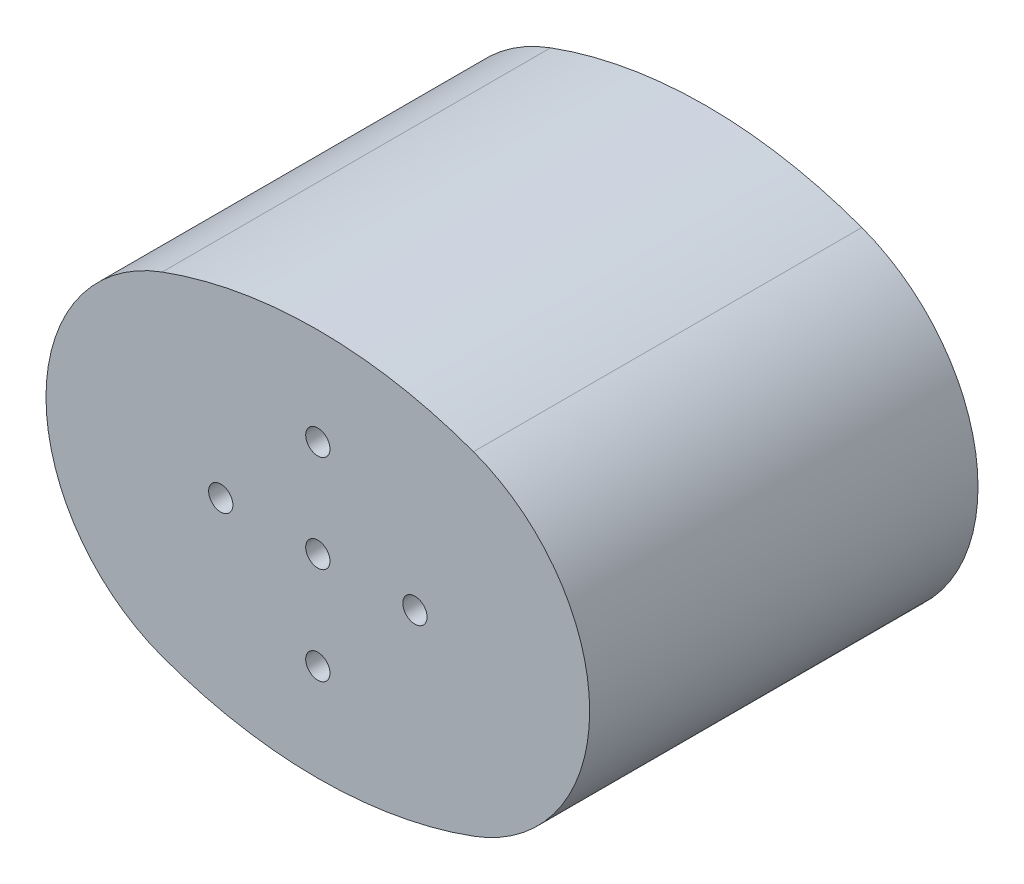
ISO-10303-21;
HEADER;
FILE_DESCRIPTION(('STEP AP214'),'2;1');
FILE_NAME('part.step','',(''),(''),'','','');
FILE_SCHEMA(('AUTOMOTIVE_DESIGN { 1 0 10303 214 1 1 1 1 }'));
ENDSEC;
DATA;
#1=APPLICATION_CONTEXT('core data for automotive mechanical design processes');
#2=APPLICATION_PROTOCOL_DEFINITION('international standard','automotive_design',2000,#1);
#3=PRODUCT_CONTEXT('',#1,'mechanical');
#4=PRODUCT('Part','Part','',(#3));
#5=PRODUCT_RELATED_PRODUCT_CATEGORY('part','',(#4));
#6=PRODUCT_DEFINITION_FORMATION('','',#4);
#7=PRODUCT_DEFINITION_CONTEXT('part definition',#1,'design');
#8=PRODUCT_DEFINITION('design','',#6,#7);
#9=PRODUCT_DEFINITION_SHAPE('','',#8);
#10=(LENGTH_UNIT() NAMED_UNIT(*) SI_UNIT(.MILLI.,.METRE.));
#11=(NAMED_UNIT(*) PLANE_ANGLE_UNIT() SI_UNIT($,.RADIAN.));
#12=(NAMED_UNIT(*) SI_UNIT($,.STERADIAN.) SOLID_ANGLE_UNIT());
#13=UNCERTAINTY_MEASURE_WITH_UNIT(LENGTH_MEASURE(1.E-05),#10,'distance_accuracy_value','');
#14=(GEOMETRIC_REPRESENTATION_CONTEXT(3) GLOBAL_UNCERTAINTY_ASSIGNED_CONTEXT((#13)) GLOBAL_UNIT_ASSIGNED_CONTEXT((#10,
#11,#12)) REPRESENTATION_CONTEXT('',''));
#15=CARTESIAN_POINT('',(0.,0.,0.));
#16=DIRECTION('',(0.,0.,1.));
#17=DIRECTION('',(1.,0.,0.));
#18=AXIS2_PLACEMENT_3D('',#15,#16,#17);
#19=CARTESIAN_POINT('',(0.,26.4889586669029,40.));
#20=DIRECTION('',(0.,0.,-1.));
#21=DIRECTION('',(-1.,0.,0.));
#22=AXIS2_PLACEMENT_3D('',#19,#20,#21);
#23=CYLINDRICAL_SURFACE('',#22,46.4889586669031);
#24=CARTESIAN_POINT('',(0.,26.4889586669029,0.));
#25=DIRECTION('',(0.,0.,1.));
#26=DIRECTION('',(1.,0.,0.));
#27=AXIS2_PLACEMENT_3D('',#24,#25,#26);
#28=CIRCLE('',#27,46.4889586669031);
#29=CARTESIAN_POINT('',(-16.0303859502735,-17.1487544287475,0.));
#30=VERTEX_POINT('',#29);
#31=CARTESIAN_POINT('',(16.0303859502735,-17.1487544287475,0.));
#32=VERTEX_POINT('',#31);
#33=EDGE_CURVE('E98',#30,#32,#28,.T.);
#34=ORIENTED_EDGE('',*,*,#33,.T.);
#35=DIRECTION('',(0.,0.,-1.));
#36=VECTOR('',#35,1.);
#37=CARTESIAN_POINT('',(16.0303859502735,-17.1487544287475,40.));
#38=LINE('',#37,#36);
#39=CARTESIAN_POINT('',(16.0303859502735,-17.1487544287475,40.));
#40=VERTEX_POINT('',#39);
#41=EDGE_CURVE('E11',#40,#32,#38,.T.);
#42=ORIENTED_EDGE('',*,*,#41,.F.);
#43=CARTESIAN_POINT('',(0.,26.4889586669029,40.));
#44=DIRECTION('',(0.,0.,1.));
#45=DIRECTION('',(1.,0.,0.));
#46=AXIS2_PLACEMENT_3D('',#43,#44,#45);
#47=CIRCLE('',#46,46.4889586669031);
#48=CARTESIAN_POINT('',(-16.0303859502735,-17.1487544287475,40.));
#49=VERTEX_POINT('',#48);
#50=EDGE_CURVE('E86',#49,#40,#47,.T.);
#51=ORIENTED_EDGE('',*,*,#50,.F.);
#52=DIRECTION('',(0.,0.,-1.));
#53=VECTOR('',#52,1.);
#54=CARTESIAN_POINT('',(-16.0303859502735,-17.1487544287475,40.));
#55=LINE('',#54,#53);
#56=EDGE_CURVE('E94',#49,#30,#55,.T.);
#57=ORIENTED_EDGE('',*,*,#56,.T.);
#58=EDGE_LOOP('',(#34,#42,#51,#57));
#59=FACE_BOUND('',#58,.T.);
#60=ADVANCED_FACE('F35',(#59),#23,.T.);
#61=CARTESIAN_POINT('',(9.73076269878195,0.,40.));
#62=DIRECTION('',(0.,0.,-1.));
#63=DIRECTION('',(-1.,0.,0.));
#64=AXIS2_PLACEMENT_3D('',#61,#62,#63);
#65=CYLINDRICAL_SURFACE('',#64,18.2692373012181);
#66=CARTESIAN_POINT('',(9.73076269878195,0.,0.));
#67=DIRECTION('',(0.,0.,1.));
#68=DIRECTION('',(1.,0.,0.));
#69=AXIS2_PLACEMENT_3D('',#66,#67,#68);
#70=CIRCLE('',#69,18.2692373012181);
#71=CARTESIAN_POINT('',(16.0303859502735,17.1487544287475,0.));
#72=VERTEX_POINT('',#71);
#73=EDGE_CURVE('E90',#32,#72,#70,.T.);
#74=ORIENTED_EDGE('',*,*,#73,.T.);
#75=DIRECTION('',(0.,0.,-1.));
#76=VECTOR('',#75,1.);
#77=CARTESIAN_POINT('',(16.0303859502735,17.1487544287475,40.));
#78=LINE('',#77,#76);
#79=CARTESIAN_POINT('',(16.0303859502735,17.1487544287475,40.));
#80=VERTEX_POINT('',#79);
#81=EDGE_CURVE('E43',#80,#72,#78,.T.);
#82=ORIENTED_EDGE('',*,*,#81,.F.);
#83=CARTESIAN_POINT('',(9.73076269878195,0.,40.));
#84=DIRECTION('',(0.,0.,1.));
#85=DIRECTION('',(1.,0.,0.));
#86=AXIS2_PLACEMENT_3D('',#83,#84,#85);
#87=CIRCLE('',#86,18.2692373012181);
#88=EDGE_CURVE('E81',#40,#80,#87,.T.);
#89=ORIENTED_EDGE('',*,*,#88,.F.);
#90=ORIENTED_EDGE('',*,*,#41,.T.);
#91=EDGE_LOOP('',(#74,#82,#89,#90));
#92=FACE_BOUND('',#91,.T.);
#93=ADVANCED_FACE('F89',(#92),#65,.T.);
#94=CARTESIAN_POINT('',(0.,-26.4889586669029,40.));
#95=DIRECTION('',(0.,0.,-1.));
#96=DIRECTION('',(-1.,0.,0.));
#97=AXIS2_PLACEMENT_3D('',#94,#95,#96);
#98=CYLINDRICAL_SURFACE('',#97,46.4889586669031);
#99=CARTESIAN_POINT('',(0.,-26.4889586669029,0.));
#100=DIRECTION('',(0.,0.,1.));
#101=DIRECTION('',(1.,0.,0.));
#102=AXIS2_PLACEMENT_3D('',#99,#100,#101);
#103=CIRCLE('',#102,46.4889586669031);
#104=CARTESIAN_POINT('',(-16.0303859502735,17.1487544287475,0.));
#105=VERTEX_POINT('',#104);
#106=EDGE_CURVE('E68',#72,#105,#103,.T.);
#107=ORIENTED_EDGE('',*,*,#106,.T.);
#108=DIRECTION('',(0.,0.,-1.));
#109=VECTOR('',#108,1.);
#110=CARTESIAN_POINT('',(-16.0303859502735,17.1487544287475,40.));
#111=LINE('',#110,#109);
#112=CARTESIAN_POINT('',(-16.0303859502735,17.1487544287475,40.));
#113=VERTEX_POINT('',#112);
#114=EDGE_CURVE('E91',#113,#105,#111,.T.);
#115=ORIENTED_EDGE('',*,*,#114,.F.);
#116=CARTESIAN_POINT('',(0.,-26.4889586669029,40.));
#117=DIRECTION('',(0.,0.,1.));
#118=DIRECTION('',(1.,0.,0.));
#119=AXIS2_PLACEMENT_3D('',#116,#117,#118);
#120=CIRCLE('',#119,46.4889586669031);
#121=EDGE_CURVE('E84',#80,#113,#120,.T.);
#122=ORIENTED_EDGE('',*,*,#121,.F.);
#123=ORIENTED_EDGE('',*,*,#81,.T.);
#124=EDGE_LOOP('',(#107,#115,#122,#123));
#125=FACE_BOUND('',#124,.T.);
#126=ADVANCED_FACE('F92',(#125),#98,.T.);
#127=CARTESIAN_POINT('',(-9.73076269878195,0.,40.));
#128=DIRECTION('',(0.,0.,-1.));
#129=DIRECTION('',(-1.,0.,0.));
#130=AXIS2_PLACEMENT_3D('',#127,#128,#129);
#131=CYLINDRICAL_SURFACE('',#130,18.2692373012181);
#132=CARTESIAN_POINT('',(-9.73076269878195,0.,0.));
#133=DIRECTION('',(0.,0.,1.));
#134=DIRECTION('',(1.,0.,0.));
#135=AXIS2_PLACEMENT_3D('',#132,#133,#134);
#136=CIRCLE('',#135,18.2692373012181);
#137=EDGE_CURVE('E74',#105,#30,#136,.T.);
#138=ORIENTED_EDGE('',*,*,#137,.T.);
#139=ORIENTED_EDGE('',*,*,#56,.F.);
#140=CARTESIAN_POINT('',(-9.73076269878195,0.,40.));
#141=DIRECTION('',(0.,0.,1.));
#142=DIRECTION('',(1.,0.,0.));
#143=AXIS2_PLACEMENT_3D('',#140,#141,#142);
#144=CIRCLE('',#143,18.2692373012181);
#145=EDGE_CURVE('E51',#113,#49,#144,.T.);
#146=ORIENTED_EDGE('',*,*,#145,.F.);
#147=ORIENTED_EDGE('',*,*,#114,.T.);
#148=EDGE_LOOP('',(#138,#139,#146,#147));
#149=FACE_BOUND('',#148,.T.);
#150=ADVANCED_FACE('F106',(#149),#131,.T.);
#151=CARTESIAN_POINT('',(4.86538134939097,13.2444793334515,40.));
#152=DIRECTION('',(0.,0.,1.));
#153=DIRECTION('',(1.,0.,0.));
#154=AXIS2_PLACEMENT_3D('',#151,#152,#153);
#155=PLANE('',#154);
#156=CARTESIAN_POINT('',(0.,10.,40.));
#157=DIRECTION('',(0.,0.,1.));
#158=DIRECTION('',(1.,0.,0.));
#159=AXIS2_PLACEMENT_3D('',#156,#157,#158);
#160=CIRCLE('',#159,1.25);
#161=CARTESIAN_POINT('',(1.25,10.,40.));
#162=VERTEX_POINT('',#161);
#163=EDGE_CURVE('E125',#162,#162,#160,.T.);
#164=ORIENTED_EDGE('',*,*,#163,.F.);
#165=EDGE_LOOP('',(#164));
#166=FACE_BOUND('',#165,.T.);
#167=CARTESIAN_POINT('',(-10.,1.04744440165294E-13,40.));
#168=DIRECTION('',(0.,0.,1.));
#169=DIRECTION('',(1.,0.,0.));
#170=AXIS2_PLACEMENT_3D('',#167,#168,#169);
#171=CIRCLE('',#170,1.25);
#172=CARTESIAN_POINT('',(-8.75,1.04744440165294E-13,40.));
#173=VERTEX_POINT('',#172);
#174=EDGE_CURVE('E126',#173,#173,#171,.T.);
#175=ORIENTED_EDGE('',*,*,#174,.F.);
#176=EDGE_LOOP('',(#175));
#177=FACE_BOUND('',#176,.T.);
#178=CARTESIAN_POINT('',(0.,-10.,40.));
#179=DIRECTION('',(0.,0.,1.));
#180=DIRECTION('',(1.,0.,0.));
#181=AXIS2_PLACEMENT_3D('',#178,#179,#180);
#182=CIRCLE('',#181,1.25);
#183=CARTESIAN_POINT('',(1.24999999999993,-10.,40.));
#184=VERTEX_POINT('',#183);
#185=EDGE_CURVE('E132',#184,#184,#182,.T.);
#186=ORIENTED_EDGE('',*,*,#185,.F.);
#187=EDGE_LOOP('',(#186));
#188=FACE_BOUND('',#187,.T.);
#189=CARTESIAN_POINT('',(10.,0.,40.));
#190=DIRECTION('',(0.,0.,1.));
#191=DIRECTION('',(1.,0.,0.));
#192=AXIS2_PLACEMENT_3D('',#189,#190,#191);
#193=CIRCLE('',#192,1.25);
#194=CARTESIAN_POINT('',(11.25,0.,40.));
#195=VERTEX_POINT('',#194);
#196=EDGE_CURVE('E112',#195,#195,#193,.T.);
#197=ORIENTED_EDGE('',*,*,#196,.F.);
#198=EDGE_LOOP('',(#197));
#199=FACE_BOUND('',#198,.T.);
#200=CARTESIAN_POINT('',(0.,0.,40.));
#201=DIRECTION('',(0.,0.,1.));
#202=DIRECTION('',(1.,0.,0.));
#203=AXIS2_PLACEMENT_3D('',#200,#201,#202);
#204=CIRCLE('',#203,1.25);
#205=CARTESIAN_POINT('',(1.25,0.,40.));
#206=VERTEX_POINT('',#205);
#207=EDGE_CURVE('E119',#206,#206,#204,.T.);
#208=ORIENTED_EDGE('',*,*,#207,.F.);
#209=EDGE_LOOP('',(#208));
#210=FACE_BOUND('',#209,.T.);
#211=ORIENTED_EDGE('',*,*,#50,.T.);
#212=ORIENTED_EDGE('',*,*,#88,.T.);
#213=ORIENTED_EDGE('',*,*,#121,.T.);
#214=ORIENTED_EDGE('',*,*,#145,.T.);
#215=EDGE_LOOP('',(#211,#212,#213,#214));
#216=FACE_BOUND('',#215,.T.);
#217=ADVANCED_FACE('F82',(#166,#177,#188,#199,#210,#216),#155,.T.);
#218=CARTESIAN_POINT('',(4.86538134939097,13.2444793334515,0.));
#219=DIRECTION('',(0.,0.,1.));
#220=DIRECTION('',(1.,0.,0.));
#221=AXIS2_PLACEMENT_3D('',#218,#219,#220);
#222=PLANE('',#221);
#223=CARTESIAN_POINT('',(0.,10.,0.));
#224=DIRECTION('',(0.,0.,1.));
#225=DIRECTION('',(1.,0.,0.));
#226=AXIS2_PLACEMENT_3D('',#223,#224,#225);
#227=CIRCLE('',#226,1.25);
#228=CARTESIAN_POINT('',(1.25,10.,0.));
#229=VERTEX_POINT('',#228);
#230=EDGE_CURVE('E101',#229,#229,#227,.T.);
#231=ORIENTED_EDGE('',*,*,#230,.T.);
#232=EDGE_LOOP('',(#231));
#233=FACE_BOUND('',#232,.T.);
#234=CARTESIAN_POINT('',(-10.,1.04744440165294E-13,0.));
#235=DIRECTION('',(0.,0.,1.));
#236=DIRECTION('',(1.,0.,0.));
#237=AXIS2_PLACEMENT_3D('',#234,#235,#236);
#238=CIRCLE('',#237,1.25);
#239=CARTESIAN_POINT('',(-8.75,1.04744440165294E-13,0.));
#240=VERTEX_POINT('',#239);
#241=EDGE_CURVE('E129',#240,#240,#238,.T.);
#242=ORIENTED_EDGE('',*,*,#241,.T.);
#243=EDGE_LOOP('',(#242));
#244=FACE_BOUND('',#243,.T.);
#245=CARTESIAN_POINT('',(0.,-10.,0.));
#246=DIRECTION('',(0.,0.,1.));
#247=DIRECTION('',(1.,0.,0.));
#248=AXIS2_PLACEMENT_3D('',#245,#246,#247);
#249=CIRCLE('',#248,1.25);
#250=CARTESIAN_POINT('',(1.24999999999993,-10.,0.));
#251=VERTEX_POINT('',#250);
#252=EDGE_CURVE('E116',#251,#251,#249,.T.);
#253=ORIENTED_EDGE('',*,*,#252,.T.);
#254=EDGE_LOOP('',(#253));
#255=FACE_BOUND('',#254,.T.);
#256=CARTESIAN_POINT('',(10.,0.,0.));
#257=DIRECTION('',(0.,0.,1.));
#258=DIRECTION('',(1.,0.,0.));
#259=AXIS2_PLACEMENT_3D('',#256,#257,#258);
#260=CIRCLE('',#259,1.25);
#261=CARTESIAN_POINT('',(11.25,0.,0.));
#262=VERTEX_POINT('',#261);
#263=EDGE_CURVE('E115',#262,#262,#260,.T.);
#264=ORIENTED_EDGE('',*,*,#263,.T.);
#265=EDGE_LOOP('',(#264));
#266=FACE_BOUND('',#265,.T.);
#267=CARTESIAN_POINT('',(0.,0.,0.));
#268=DIRECTION('',(0.,0.,1.));
#269=DIRECTION('',(1.,0.,0.));
#270=AXIS2_PLACEMENT_3D('',#267,#268,#269);
#271=CIRCLE('',#270,1.25);
#272=CARTESIAN_POINT('',(1.25,0.,0.));
#273=VERTEX_POINT('',#272);
#274=EDGE_CURVE('E122',#273,#273,#271,.T.);
#275=ORIENTED_EDGE('',*,*,#274,.T.);
#276=EDGE_LOOP('',(#275));
#277=FACE_BOUND('',#276,.T.);
#278=ORIENTED_EDGE('',*,*,#33,.F.);
#279=ORIENTED_EDGE('',*,*,#137,.F.);
#280=ORIENTED_EDGE('',*,*,#106,.F.);
#281=ORIENTED_EDGE('',*,*,#73,.F.);
#282=EDGE_LOOP('',(#278,#279,#280,#281));
#283=FACE_BOUND('',#282,.T.);
#284=ADVANCED_FACE('F109',(#233,#244,#255,#266,#277,#283),#222,.F.);
#285=CARTESIAN_POINT('',(0.,0.,0.));
#286=DIRECTION('',(0.,0.,1.));
#287=DIRECTION('',(1.,0.,0.));
#288=AXIS2_PLACEMENT_3D('',#285,#286,#287);
#289=CYLINDRICAL_SURFACE('',#288,1.25);
#290=ORIENTED_EDGE('',*,*,#274,.F.);
#291=EDGE_LOOP('',(#290));
#292=FACE_BOUND('',#291,.T.);
#293=ORIENTED_EDGE('',*,*,#207,.T.);
#294=EDGE_LOOP('',(#293));
#295=FACE_BOUND('',#294,.T.);
#296=ADVANCED_FACE('F162',(#292,#295),#289,.F.);
#297=CARTESIAN_POINT('',(10.,0.,0.));
#298=DIRECTION('',(0.,0.,1.));
#299=DIRECTION('',(1.,0.,0.));
#300=AXIS2_PLACEMENT_3D('',#297,#298,#299);
#301=CYLINDRICAL_SURFACE('',#300,1.25);
#302=ORIENTED_EDGE('',*,*,#263,.F.);
#303=EDGE_LOOP('',(#302));
#304=FACE_BOUND('',#303,.T.);
#305=ORIENTED_EDGE('',*,*,#196,.T.);
#306=EDGE_LOOP('',(#305));
#307=FACE_BOUND('',#306,.T.);
#308=ADVANCED_FACE('F164',(#304,#307),#301,.F.);
#309=CARTESIAN_POINT('',(0.,-10.,0.));
#310=DIRECTION('',(0.,0.,1.));
#311=DIRECTION('',(1.,0.,0.));
#312=AXIS2_PLACEMENT_3D('',#309,#310,#311);
#313=CYLINDRICAL_SURFACE('',#312,1.25);
#314=ORIENTED_EDGE('',*,*,#252,.F.);
#315=EDGE_LOOP('',(#314));
#316=FACE_BOUND('',#315,.T.);
#317=ORIENTED_EDGE('',*,*,#185,.T.);
#318=EDGE_LOOP('',(#317));
#319=FACE_BOUND('',#318,.T.);
#320=ADVANCED_FACE('F171',(#316,#319),#313,.F.);
#321=CARTESIAN_POINT('',(-10.,1.04744440165294E-13,0.));
#322=DIRECTION('',(0.,0.,1.));
#323=DIRECTION('',(1.,0.,0.));
#324=AXIS2_PLACEMENT_3D('',#321,#322,#323);
#325=CYLINDRICAL_SURFACE('',#324,1.25);
#326=ORIENTED_EDGE('',*,*,#241,.F.);
#327=EDGE_LOOP('',(#326));
#328=FACE_BOUND('',#327,.T.);
#329=ORIENTED_EDGE('',*,*,#174,.T.);
#330=EDGE_LOOP('',(#329));
#331=FACE_BOUND('',#330,.T.);
#332=ADVANCED_FACE('F147',(#328,#331),#325,.F.);
#333=CARTESIAN_POINT('',(0.,10.,0.));
#334=DIRECTION('',(0.,0.,1.));
#335=DIRECTION('',(1.,0.,0.));
#336=AXIS2_PLACEMENT_3D('',#333,#334,#335);
#337=CYLINDRICAL_SURFACE('',#336,1.25);
#338=ORIENTED_EDGE('',*,*,#230,.F.);
#339=EDGE_LOOP('',(#338));
#340=FACE_BOUND('',#339,.T.);
#341=ORIENTED_EDGE('',*,*,#163,.T.);
#342=EDGE_LOOP('',(#341));
#343=FACE_BOUND('',#342,.T.);
#344=ADVANCED_FACE('F144',(#340,#343),#337,.F.);
#345=CLOSED_SHELL('',(#60,#93,#126,#150,#217,#284,#296,#308,#320,#332,#344));
#346=MANIFOLD_SOLID_BREP('B2',#345);
#347=ADVANCED_BREP_SHAPE_REPRESENTATION('',(#18,#346),#14);
#348=SHAPE_DEFINITION_REPRESENTATION(#9,#347);
ENDSEC;
END-ISO-10303-21;
